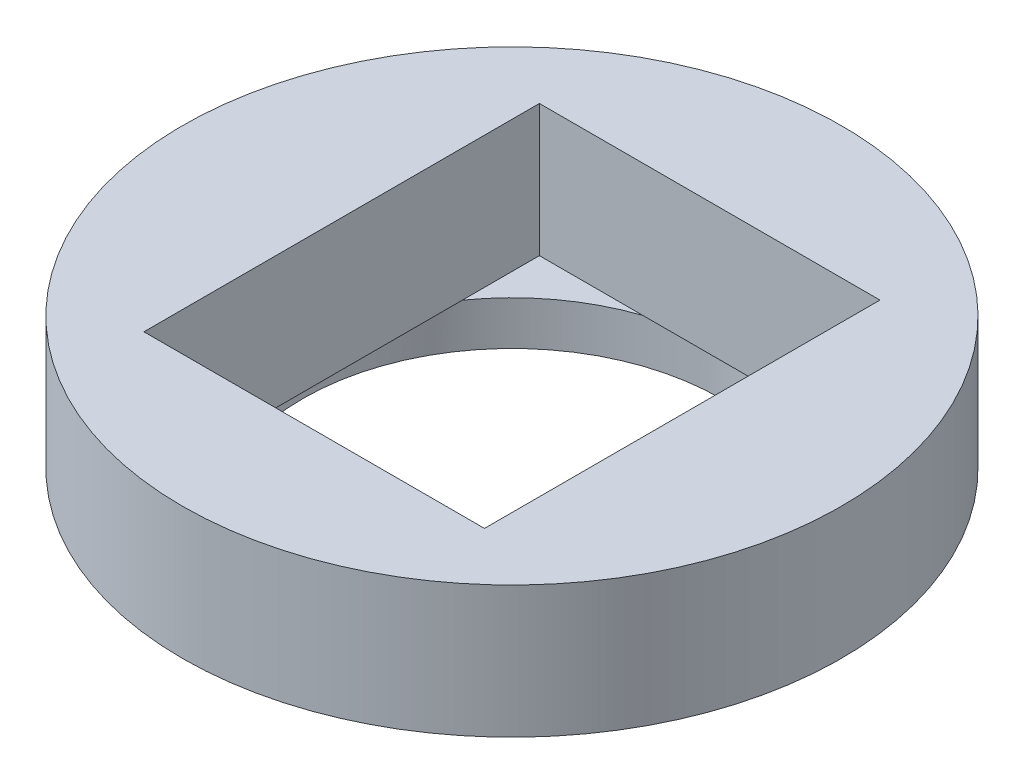
ISO-10303-21;
HEADER;
FILE_DESCRIPTION(('STEP AP214'),'2;1');
FILE_NAME('part.step','',(''),(''),'','','');
FILE_SCHEMA(('AUTOMOTIVE_DESIGN { 1 0 10303 214 1 1 1 1 }'));
ENDSEC;
DATA;
#1=APPLICATION_CONTEXT('core data for automotive mechanical design processes');
#2=APPLICATION_PROTOCOL_DEFINITION('international standard','automotive_design',2000,#1);
#3=PRODUCT_CONTEXT('',#1,'mechanical');
#4=PRODUCT('Part','Part','',(#3));
#5=PRODUCT_RELATED_PRODUCT_CATEGORY('part','',(#4));
#6=PRODUCT_DEFINITION_FORMATION('','',#4);
#7=PRODUCT_DEFINITION_CONTEXT('part definition',#1,'design');
#8=PRODUCT_DEFINITION('design','',#6,#7);
#9=PRODUCT_DEFINITION_SHAPE('','',#8);
#10=(LENGTH_UNIT() NAMED_UNIT(*) SI_UNIT(.MILLI.,.METRE.));
#11=(NAMED_UNIT(*) PLANE_ANGLE_UNIT() SI_UNIT($,.RADIAN.));
#12=(NAMED_UNIT(*) SI_UNIT($,.STERADIAN.) SOLID_ANGLE_UNIT());
#13=UNCERTAINTY_MEASURE_WITH_UNIT(LENGTH_MEASURE(1.E-05),#10,'distance_accuracy_value','');
#14=(GEOMETRIC_REPRESENTATION_CONTEXT(3) GLOBAL_UNCERTAINTY_ASSIGNED_CONTEXT((#13)) GLOBAL_UNIT_ASSIGNED_CONTEXT((#10,
#11,#12)) REPRESENTATION_CONTEXT('',''));
#15=CARTESIAN_POINT('',(0.,0.,0.));
#16=DIRECTION('',(0.,0.,1.));
#17=DIRECTION('',(1.,0.,0.));
#18=AXIS2_PLACEMENT_3D('',#15,#16,#17);
#19=CARTESIAN_POINT('',(0.,2.,0.));
#20=DIRECTION('',(0.,1.,0.));
#21=DIRECTION('',(0.,0.,1.));
#22=AXIS2_PLACEMENT_3D('',#19,#20,#21);
#23=PLANE('',#22);
#24=CARTESIAN_POINT('',(0.,2.,0.));
#25=DIRECTION('',(0.,1.,0.));
#26=DIRECTION('',(0.,0.,1.));
#27=AXIS2_PLACEMENT_3D('',#24,#25,#26);
#28=CIRCLE('',#27,9.5);
#29=CARTESIAN_POINT('',(7.75,2.,-5.49431524395898));
#30=VERTEX_POINT('',#29);
#31=CARTESIAN_POINT('',(3.04138126514911,2.,-9.));
#32=VERTEX_POINT('',#31);
#33=EDGE_CURVE('E283',#30,#32,#28,.T.);
#34=ORIENTED_EDGE('',*,*,#33,.F.);
#35=DIRECTION('',(0.,0.,-1.));
#36=VECTOR('',#35,1.);
#37=CARTESIAN_POINT('',(7.75,2.,9.));
#38=LINE('',#37,#36);
#39=CARTESIAN_POINT('',(7.75,2.,-9.));
#40=VERTEX_POINT('',#39);
#41=EDGE_CURVE('E12',#30,#40,#38,.T.);
#42=ORIENTED_EDGE('',*,*,#41,.T.);
#43=DIRECTION('',(1.,0.,0.));
#44=VECTOR('',#43,1.);
#45=CARTESIAN_POINT('',(-7.75,2.,-9.));
#46=LINE('',#45,#44);
#47=EDGE_CURVE('E70',#32,#40,#46,.T.);
#48=ORIENTED_EDGE('',*,*,#47,.F.);
#49=EDGE_LOOP('',(#34,#42,#48));
#50=FACE_BOUND('',#49,.T.);
#51=ADVANCED_FACE('F60',(#50),#23,.T.);
#52=CARTESIAN_POINT('',(-7.75,2.,-9.));
#53=VERTEX_POINT('',#52);
#54=CARTESIAN_POINT('',(-3.04138126514911,2.,-9.));
#55=VERTEX_POINT('',#54);
#56=EDGE_CURVE('E174',#53,#55,#46,.T.);
#57=ORIENTED_EDGE('',*,*,#56,.F.);
#58=DIRECTION('',(0.,0.,-1.));
#59=VECTOR('',#58,1.);
#60=CARTESIAN_POINT('',(-7.75,2.,9.));
#61=LINE('',#60,#59);
#62=CARTESIAN_POINT('',(-7.75,2.,-5.49431524395898));
#63=VERTEX_POINT('',#62);
#64=EDGE_CURVE('E139',#63,#53,#61,.T.);
#65=ORIENTED_EDGE('',*,*,#64,.F.);
#66=EDGE_CURVE('E277',#55,#63,#28,.T.);
#67=ORIENTED_EDGE('',*,*,#66,.F.);
#68=EDGE_LOOP('',(#57,#65,#67));
#69=FACE_BOUND('',#68,.T.);
#70=ADVANCED_FACE('F240',(#69),#23,.T.);
#71=DIRECTION('',(1.,0.,0.));
#72=VECTOR('',#71,1.);
#73=CARTESIAN_POINT('',(-7.75,2.,9.));
#74=LINE('',#73,#72);
#75=CARTESIAN_POINT('',(3.04138126514911,2.,9.));
#76=VERTEX_POINT('',#75);
#77=CARTESIAN_POINT('',(7.75,2.,9.));
#78=VERTEX_POINT('',#77);
#79=EDGE_CURVE('E86',#76,#78,#74,.T.);
#80=ORIENTED_EDGE('',*,*,#79,.T.);
#81=CARTESIAN_POINT('',(7.75,2.,5.49431524395898));
#82=VERTEX_POINT('',#81);
#83=EDGE_CURVE('E72',#78,#82,#38,.T.);
#84=ORIENTED_EDGE('',*,*,#83,.T.);
#85=EDGE_CURVE('E198',#76,#82,#28,.T.);
#86=ORIENTED_EDGE('',*,*,#85,.F.);
#87=EDGE_LOOP('',(#80,#84,#86));
#88=FACE_BOUND('',#87,.T.);
#89=ADVANCED_FACE('F245',(#88),#23,.T.);
#90=CARTESIAN_POINT('',(-7.75,2.,9.));
#91=VERTEX_POINT('',#90);
#92=CARTESIAN_POINT('',(-7.75,2.,5.49431524395898));
#93=VERTEX_POINT('',#92);
#94=EDGE_CURVE('E184',#91,#93,#61,.T.);
#95=ORIENTED_EDGE('',*,*,#94,.F.);
#96=CARTESIAN_POINT('',(-3.04138126514911,2.,9.));
#97=VERTEX_POINT('',#96);
#98=EDGE_CURVE('E179',#91,#97,#74,.T.);
#99=ORIENTED_EDGE('',*,*,#98,.T.);
#100=EDGE_CURVE('E258',#93,#97,#28,.T.);
#101=ORIENTED_EDGE('',*,*,#100,.F.);
#102=EDGE_LOOP('',(#95,#99,#101));
#103=FACE_BOUND('',#102,.T.);
#104=ADVANCED_FACE('F220',(#103),#23,.T.);
#105=CARTESIAN_POINT('',(0.,0.,0.));
#106=DIRECTION('',(0.,1.,0.));
#107=DIRECTION('',(0.,0.,1.));
#108=AXIS2_PLACEMENT_3D('',#105,#106,#107);
#109=PLANE('',#108);
#110=CARTESIAN_POINT('',(0.,0.,0.));
#111=DIRECTION('',(0.,1.,0.));
#112=DIRECTION('',(0.,0.,1.));
#113=AXIS2_PLACEMENT_3D('',#110,#111,#112);
#114=CIRCLE('',#113,11.975);
#115=CARTESIAN_POINT('',(0.,0.,11.975));
#116=VERTEX_POINT('',#115);
#117=EDGE_CURVE('E64',#116,#116,#114,.T.);
#118=ORIENTED_EDGE('',*,*,#117,.F.);
#119=EDGE_LOOP('',(#118));
#120=FACE_BOUND('',#119,.T.);
#121=CARTESIAN_POINT('',(0.,0.,0.));
#122=DIRECTION('',(0.,1.,0.));
#123=DIRECTION('',(0.,0.,1.));
#124=AXIS2_PLACEMENT_3D('',#121,#122,#123);
#125=CIRCLE('',#124,9.5);
#126=CARTESIAN_POINT('',(0.,0.,9.5));
#127=VERTEX_POINT('',#126);
#128=EDGE_CURVE('E197',#127,#127,#125,.T.);
#129=ORIENTED_EDGE('',*,*,#128,.T.);
#130=EDGE_LOOP('',(#129));
#131=FACE_BOUND('',#130,.T.);
#132=ADVANCED_FACE('F217',(#120,#131),#109,.F.);
#133=CARTESIAN_POINT('',(0.,2.,0.));
#134=DIRECTION('',(0.,-1.,0.));
#135=DIRECTION('',(0.,0.,-1.));
#136=AXIS2_PLACEMENT_3D('',#133,#134,#135);
#137=CYLINDRICAL_SURFACE('',#136,11.975);
#138=CARTESIAN_POINT('',(0.,2.,0.));
#139=DIRECTION('',(0.,1.,0.));
#140=DIRECTION('',(0.,0.,1.));
#141=AXIS2_PLACEMENT_3D('',#138,#139,#140);
#142=CIRCLE('',#141,11.975);
#143=CARTESIAN_POINT('',(0.,2.,11.975));
#144=VERTEX_POINT('',#143);
#145=EDGE_CURVE('E206',#144,#144,#142,.T.);
#146=ORIENTED_EDGE('',*,*,#145,.F.);
#147=EDGE_LOOP('',(#146));
#148=FACE_BOUND('',#147,.T.);
#149=ORIENTED_EDGE('',*,*,#117,.T.);
#150=EDGE_LOOP('',(#149));
#151=FACE_BOUND('',#150,.T.);
#152=ADVANCED_FACE('F62',(#148,#151),#137,.T.);
#153=CARTESIAN_POINT('',(0.,2.,0.));
#154=DIRECTION('',(0.,-1.,0.));
#155=DIRECTION('',(0.,0.,-1.));
#156=AXIS2_PLACEMENT_3D('',#153,#154,#155);
#157=CYLINDRICAL_SURFACE('',#156,9.5);
#158=ORIENTED_EDGE('',*,*,#85,.T.);
#159=EDGE_CURVE('E202',#82,#30,#28,.T.);
#160=ORIENTED_EDGE('',*,*,#159,.T.);
#161=ORIENTED_EDGE('',*,*,#33,.T.);
#162=EDGE_CURVE('E280',#32,#55,#28,.T.);
#163=ORIENTED_EDGE('',*,*,#162,.T.);
#164=ORIENTED_EDGE('',*,*,#66,.T.);
#165=EDGE_CURVE('E275',#63,#93,#28,.T.);
#166=ORIENTED_EDGE('',*,*,#165,.T.);
#167=ORIENTED_EDGE('',*,*,#100,.T.);
#168=EDGE_CURVE('E203',#97,#76,#28,.T.);
#169=ORIENTED_EDGE('',*,*,#168,.T.);
#170=EDGE_LOOP('',(#158,#160,#161,#163,#164,#166,#167,#169));
#171=FACE_BOUND('',#170,.T.);
#172=ORIENTED_EDGE('',*,*,#128,.F.);
#173=EDGE_LOOP('',(#172));
#174=FACE_BOUND('',#173,.T.);
#175=ADVANCED_FACE('F223',(#171,#174),#157,.F.);
#176=CARTESIAN_POINT('',(0.,2.,0.));
#177=DIRECTION('',(0.,1.,0.));
#178=DIRECTION('',(0.,0.,1.));
#179=AXIS2_PLACEMENT_3D('',#176,#177,#178);
#180=PLANE('',#179);
#181=CARTESIAN_POINT('',(0.,2.,0.));
#182=DIRECTION('',(0.,1.,0.));
#183=DIRECTION('',(0.,0.,1.));
#184=AXIS2_PLACEMENT_3D('',#181,#182,#183);
#185=CIRCLE('',#184,15.);
#186=CARTESIAN_POINT('',(0.,2.,15.));
#187=VERTEX_POINT('',#186);
#188=EDGE_CURVE('E144',#187,#187,#185,.T.);
#189=ORIENTED_EDGE('',*,*,#188,.F.);
#190=EDGE_LOOP('',(#189));
#191=FACE_BOUND('',#190,.T.);
#192=ORIENTED_EDGE('',*,*,#145,.T.);
#193=EDGE_LOOP('',(#192));
#194=FACE_BOUND('',#193,.T.);
#195=ADVANCED_FACE('F225',(#191,#194),#180,.F.);
#196=ORIENTED_EDGE('',*,*,#159,.F.);
#197=EDGE_CURVE('E73',#82,#30,#38,.T.);
#198=ORIENTED_EDGE('',*,*,#197,.T.);
#199=EDGE_LOOP('',(#196,#198));
#200=FACE_BOUND('',#199,.T.);
#201=ADVANCED_FACE('F232',(#200),#180,.F.);
#202=ORIENTED_EDGE('',*,*,#162,.F.);
#203=EDGE_CURVE('E173',#55,#32,#46,.T.);
#204=ORIENTED_EDGE('',*,*,#203,.F.);
#205=EDGE_LOOP('',(#202,#204));
#206=FACE_BOUND('',#205,.T.);
#207=ADVANCED_FACE('F310',(#206),#180,.F.);
#208=ORIENTED_EDGE('',*,*,#165,.F.);
#209=EDGE_CURVE('E183',#93,#63,#61,.T.);
#210=ORIENTED_EDGE('',*,*,#209,.F.);
#211=EDGE_LOOP('',(#208,#210));
#212=FACE_BOUND('',#211,.T.);
#213=ADVANCED_FACE('F304',(#212),#180,.F.);
#214=CARTESIAN_POINT('',(0.,4.,0.));
#215=DIRECTION('',(0.,-1.,0.));
#216=DIRECTION('',(0.,0.,-1.));
#217=AXIS2_PLACEMENT_3D('',#214,#215,#216);
#218=CYLINDRICAL_SURFACE('',#217,15.);
#219=ORIENTED_EDGE('',*,*,#188,.T.);
#220=EDGE_LOOP('',(#219));
#221=FACE_BOUND('',#220,.T.);
#222=CARTESIAN_POINT('',(0.,8.,0.));
#223=DIRECTION('',(0.,1.,0.));
#224=DIRECTION('',(0.,0.,1.));
#225=AXIS2_PLACEMENT_3D('',#222,#223,#224);
#226=CIRCLE('',#225,15.);
#227=CARTESIAN_POINT('',(0.,8.,15.));
#228=VERTEX_POINT('',#227);
#229=EDGE_CURVE('E163',#228,#228,#226,.T.);
#230=ORIENTED_EDGE('',*,*,#229,.F.);
#231=EDGE_LOOP('',(#230));
#232=FACE_BOUND('',#231,.T.);
#233=ADVANCED_FACE('F303',(#221,#232),#218,.T.);
#234=ORIENTED_EDGE('',*,*,#168,.F.);
#235=EDGE_CURVE('E178',#97,#76,#74,.T.);
#236=ORIENTED_EDGE('',*,*,#235,.T.);
#237=EDGE_LOOP('',(#234,#236));
#238=FACE_BOUND('',#237,.T.);
#239=ADVANCED_FACE('F235',(#238),#180,.F.);
#240=CARTESIAN_POINT('',(-7.75,4.,-9.));
#241=DIRECTION('',(0.,0.,-1.));
#242=DIRECTION('',(-1.,0.,0.));
#243=AXIS2_PLACEMENT_3D('',#240,#241,#242);
#244=PLANE('',#243);
#245=ORIENTED_EDGE('',*,*,#56,.T.);
#246=ORIENTED_EDGE('',*,*,#203,.T.);
#247=ORIENTED_EDGE('',*,*,#47,.T.);
#248=DIRECTION('',(0.,-1.,0.));
#249=VECTOR('',#248,1.);
#250=CARTESIAN_POINT('',(7.75,4.,-9.));
#251=LINE('',#250,#249);
#252=CARTESIAN_POINT('',(7.75,8.,-9.));
#253=VERTEX_POINT('',#252);
#254=EDGE_CURVE('E151',#253,#40,#251,.T.);
#255=ORIENTED_EDGE('',*,*,#254,.F.);
#256=DIRECTION('',(1.,0.,0.));
#257=VECTOR('',#256,1.);
#258=CARTESIAN_POINT('',(0.,8.,-9.));
#259=LINE('',#258,#257);
#260=CARTESIAN_POINT('',(-7.75,8.,-9.));
#261=VERTEX_POINT('',#260);
#262=EDGE_CURVE('E148',#261,#253,#259,.T.);
#263=ORIENTED_EDGE('',*,*,#262,.F.);
#264=DIRECTION('',(0.,-1.,0.));
#265=VECTOR('',#264,1.);
#266=CARTESIAN_POINT('',(-7.75,4.,-9.));
#267=LINE('',#266,#265);
#268=EDGE_CURVE('E131',#261,#53,#267,.T.);
#269=ORIENTED_EDGE('',*,*,#268,.T.);
#270=EDGE_LOOP('',(#245,#246,#247,#255,#263,#269));
#271=FACE_BOUND('',#270,.T.);
#272=ADVANCED_FACE('F149',(#271),#244,.F.);
#273=CARTESIAN_POINT('',(-7.75,4.,9.));
#274=DIRECTION('',(-1.,0.,0.));
#275=DIRECTION('',(0.,0.,1.));
#276=AXIS2_PLACEMENT_3D('',#273,#274,#275);
#277=PLANE('',#276);
#278=ORIENTED_EDGE('',*,*,#94,.T.);
#279=ORIENTED_EDGE('',*,*,#209,.T.);
#280=ORIENTED_EDGE('',*,*,#64,.T.);
#281=ORIENTED_EDGE('',*,*,#268,.F.);
#282=DIRECTION('',(0.,0.,-1.));
#283=VECTOR('',#282,1.);
#284=CARTESIAN_POINT('',(-7.75,8.,0.));
#285=LINE('',#284,#283);
#286=CARTESIAN_POINT('',(-7.75,8.,9.));
#287=VERTEX_POINT('',#286);
#288=EDGE_CURVE('E136',#287,#261,#285,.T.);
#289=ORIENTED_EDGE('',*,*,#288,.F.);
#290=DIRECTION('',(0.,-1.,0.));
#291=VECTOR('',#290,1.);
#292=CARTESIAN_POINT('',(-7.75,4.,9.));
#293=LINE('',#292,#291);
#294=EDGE_CURVE('E145',#287,#91,#293,.T.);
#295=ORIENTED_EDGE('',*,*,#294,.T.);
#296=EDGE_LOOP('',(#278,#279,#280,#281,#289,#295));
#297=FACE_BOUND('',#296,.T.);
#298=ADVANCED_FACE('F134',(#297),#277,.F.);
#299=CARTESIAN_POINT('',(-7.75,4.,9.));
#300=DIRECTION('',(0.,0.,-1.));
#301=DIRECTION('',(-1.,0.,0.));
#302=AXIS2_PLACEMENT_3D('',#299,#300,#301);
#303=PLANE('',#302);
#304=ORIENTED_EDGE('',*,*,#98,.F.);
#305=ORIENTED_EDGE('',*,*,#294,.F.);
#306=DIRECTION('',(-1.,0.,0.));
#307=VECTOR('',#306,1.);
#308=CARTESIAN_POINT('',(0.,8.,9.));
#309=LINE('',#308,#307);
#310=CARTESIAN_POINT('',(7.75,8.,9.));
#311=VERTEX_POINT('',#310);
#312=EDGE_CURVE('E161',#311,#287,#309,.T.);
#313=ORIENTED_EDGE('',*,*,#312,.F.);
#314=DIRECTION('',(0.,-1.,0.));
#315=VECTOR('',#314,1.);
#316=CARTESIAN_POINT('',(7.75,4.,9.));
#317=LINE('',#316,#315);
#318=EDGE_CURVE('E189',#311,#78,#317,.T.);
#319=ORIENTED_EDGE('',*,*,#318,.T.);
#320=ORIENTED_EDGE('',*,*,#79,.F.);
#321=ORIENTED_EDGE('',*,*,#235,.F.);
#322=EDGE_LOOP('',(#304,#305,#313,#319,#320,#321));
#323=FACE_BOUND('',#322,.T.);
#324=ADVANCED_FACE('F260',(#323),#303,.T.);
#325=CARTESIAN_POINT('',(7.75,4.,9.));
#326=DIRECTION('',(-1.,0.,0.));
#327=DIRECTION('',(0.,0.,1.));
#328=AXIS2_PLACEMENT_3D('',#325,#326,#327);
#329=PLANE('',#328);
#330=ORIENTED_EDGE('',*,*,#83,.F.);
#331=ORIENTED_EDGE('',*,*,#318,.F.);
#332=DIRECTION('',(0.,0.,1.));
#333=VECTOR('',#332,1.);
#334=CARTESIAN_POINT('',(7.75,8.,0.));
#335=LINE('',#334,#333);
#336=EDGE_CURVE('E156',#253,#311,#335,.T.);
#337=ORIENTED_EDGE('',*,*,#336,.F.);
#338=ORIENTED_EDGE('',*,*,#254,.T.);
#339=ORIENTED_EDGE('',*,*,#41,.F.);
#340=ORIENTED_EDGE('',*,*,#197,.F.);
#341=EDGE_LOOP('',(#330,#331,#337,#338,#339,#340));
#342=FACE_BOUND('',#341,.T.);
#343=ADVANCED_FACE('F289',(#342),#329,.T.);
#344=CARTESIAN_POINT('',(0.,8.,0.));
#345=DIRECTION('',(0.,1.,0.));
#346=DIRECTION('',(0.,0.,1.));
#347=AXIS2_PLACEMENT_3D('',#344,#345,#346);
#348=PLANE('',#347);
#349=ORIENTED_EDGE('',*,*,#229,.T.);
#350=EDGE_LOOP('',(#349));
#351=FACE_BOUND('',#350,.T.);
#352=ORIENTED_EDGE('',*,*,#288,.T.);
#353=ORIENTED_EDGE('',*,*,#262,.T.);
#354=ORIENTED_EDGE('',*,*,#336,.T.);
#355=ORIENTED_EDGE('',*,*,#312,.T.);
#356=EDGE_LOOP('',(#352,#353,#354,#355));
#357=FACE_BOUND('',#356,.T.);
#358=ADVANCED_FACE('F159',(#351,#357),#348,.T.);
#359=CLOSED_SHELL('',(#51,#70,#89,#104,#132,#152,#175,#195,#201,#207,#213,#233,#239,#272,#298,
#324,#343,#358));
#360=MANIFOLD_SOLID_BREP('B2',#359);
#361=ADVANCED_BREP_SHAPE_REPRESENTATION('',(#18,#360),#14);
#362=SHAPE_DEFINITION_REPRESENTATION(#9,#361);
ENDSEC;
END-ISO-10303-21;
